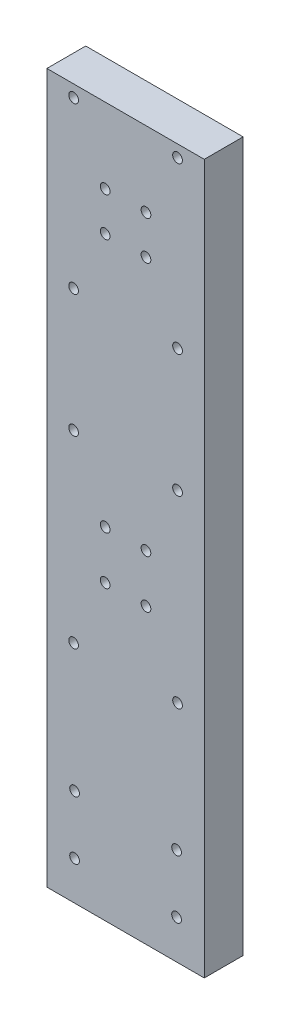
ISO-10303-21;
HEADER;
FILE_DESCRIPTION(('STEP AP214'),'2;1');
FILE_NAME('part.step','',(''),(''),'','','');
FILE_SCHEMA(('AUTOMOTIVE_DESIGN { 1 0 10303 214 1 1 1 1 }'));
ENDSEC;
DATA;
#1=APPLICATION_CONTEXT('core data for automotive mechanical design processes');
#2=APPLICATION_PROTOCOL_DEFINITION('international standard','automotive_design',2000,#1);
#3=PRODUCT_CONTEXT('',#1,'mechanical');
#4=PRODUCT('Part','Part','',(#3));
#5=PRODUCT_RELATED_PRODUCT_CATEGORY('part','',(#4));
#6=PRODUCT_DEFINITION_FORMATION('','',#4);
#7=PRODUCT_DEFINITION_CONTEXT('part definition',#1,'design');
#8=PRODUCT_DEFINITION('design','',#6,#7);
#9=PRODUCT_DEFINITION_SHAPE('','',#8);
#10=(LENGTH_UNIT() NAMED_UNIT(*) SI_UNIT(.MILLI.,.METRE.));
#11=(NAMED_UNIT(*) PLANE_ANGLE_UNIT() SI_UNIT($,.RADIAN.));
#12=(NAMED_UNIT(*) SI_UNIT($,.STERADIAN.) SOLID_ANGLE_UNIT());
#13=UNCERTAINTY_MEASURE_WITH_UNIT(LENGTH_MEASURE(1.E-05),#10,'distance_accuracy_value','');
#14=(GEOMETRIC_REPRESENTATION_CONTEXT(3) GLOBAL_UNCERTAINTY_ASSIGNED_CONTEXT((#13)) GLOBAL_UNIT_ASSIGNED_CONTEXT((#10,
#11,#12)) REPRESENTATION_CONTEXT('',''));
#15=CARTESIAN_POINT('',(0.,0.,0.));
#16=DIRECTION('',(0.,0.,1.));
#17=DIRECTION('',(1.,0.,0.));
#18=AXIS2_PLACEMENT_3D('',#15,#16,#17);
#19=CARTESIAN_POINT('',(0.,0.,4.));
#20=DIRECTION('',(0.,0.,-1.));
#21=DIRECTION('',(-1.,0.,0.));
#22=AXIS2_PLACEMENT_3D('',#19,#20,#21);
#23=PLANE('',#22);
#24=CARTESIAN_POINT('',(10.1999999999987,65.26,4.));
#25=DIRECTION('',(0.,0.,1.));
#26=DIRECTION('',(-1.,0.,0.));
#27=AXIS2_PLACEMENT_3D('',#24,#25,#26);
#28=CIRCLE('',#27,0.499999999999999);
#29=CARTESIAN_POINT('',(9.69999999999869,65.26,4.));
#30=VERTEX_POINT('',#29);
#31=EDGE_CURVE('E217',#30,#30,#28,.T.);
#32=ORIENTED_EDGE('',*,*,#31,.F.);
#33=EDGE_LOOP('',(#32));
#34=FACE_BOUND('',#33,.T.);
#35=CARTESIAN_POINT('',(2.7500000000006,54.76,4.));
#36=DIRECTION('',(0.,0.,1.));
#37=DIRECTION('',(1.,0.,0.));
#38=AXIS2_PLACEMENT_3D('',#35,#36,#37);
#39=CIRCLE('',#38,0.500000000000004);
#40=CARTESIAN_POINT('',(3.2500000000006,54.76,4.));
#41=VERTEX_POINT('',#40);
#42=EDGE_CURVE('E205',#41,#41,#39,.T.);
#43=ORIENTED_EDGE('',*,*,#42,.F.);
#44=EDGE_LOOP('',(#43));
#45=FACE_BOUND('',#44,.T.);
#46=CARTESIAN_POINT('',(13.350000000001,10.,4.));
#47=DIRECTION('',(0.,0.,1.));
#48=DIRECTION('',(-1.,0.,0.));
#49=AXIS2_PLACEMENT_3D('',#46,#47,#48);
#50=CIRCLE('',#49,0.499999999999994);
#51=CARTESIAN_POINT('',(12.850000000001,10.,4.));
#52=VERTEX_POINT('',#51);
#53=EDGE_CURVE('E193',#52,#52,#50,.T.);
#54=ORIENTED_EDGE('',*,*,#53,.F.);
#55=EDGE_LOOP('',(#54));
#56=FACE_BOUND('',#55,.T.);
#57=CARTESIAN_POINT('',(13.4500000000019,54.76,4.));
#58=DIRECTION('',(0.,0.,1.));
#59=DIRECTION('',(1.,0.,0.));
#60=AXIS2_PLACEMENT_3D('',#57,#58,#59);
#61=CIRCLE('',#60,0.499999999999999);
#62=CARTESIAN_POINT('',(13.9500000000019,54.76,4.));
#63=VERTEX_POINT('',#62);
#64=EDGE_CURVE('E181',#63,#63,#61,.T.);
#65=ORIENTED_EDGE('',*,*,#64,.F.);
#66=EDGE_LOOP('',(#65));
#67=FACE_BOUND('',#66,.T.);
#68=CARTESIAN_POINT('',(2.84999999999999,10.,4.));
#69=DIRECTION('',(0.,0.,1.));
#70=DIRECTION('',(1.,0.,0.));
#71=AXIS2_PLACEMENT_3D('',#68,#69,#70);
#72=CIRCLE('',#71,0.499999999999999);
#73=CARTESIAN_POINT('',(3.34999999999999,10.,4.));
#74=VERTEX_POINT('',#73);
#75=EDGE_CURVE('E169',#74,#74,#72,.T.);
#76=ORIENTED_EDGE('',*,*,#75,.F.);
#77=EDGE_LOOP('',(#76));
#78=FACE_BOUND('',#77,.T.);
#79=CARTESIAN_POINT('',(6.00000000000001,35.11,4.));
#80=DIRECTION('',(0.,0.,1.));
#81=DIRECTION('',(1.,0.,0.));
#82=AXIS2_PLACEMENT_3D('',#79,#80,#81);
#83=CIRCLE('',#82,0.500000000000002);
#84=CARTESIAN_POINT('',(6.50000000000001,35.11,4.));
#85=VERTEX_POINT('',#84);
#86=EDGE_CURVE('E157',#85,#85,#83,.T.);
#87=ORIENTED_EDGE('',*,*,#86,.F.);
#88=EDGE_LOOP('',(#87));
#89=FACE_BOUND('',#88,.T.);
#90=CARTESIAN_POINT('',(10.2000000000001,35.11,4.));
#91=DIRECTION('',(0.,0.,1.));
#92=DIRECTION('',(1.,0.,0.));
#93=AXIS2_PLACEMENT_3D('',#90,#91,#92);
#94=CIRCLE('',#93,0.499999999999999);
#95=CARTESIAN_POINT('',(10.7000000000001,35.11,4.));
#96=VERTEX_POINT('',#95);
#97=EDGE_CURVE('E145',#96,#96,#94,.T.);
#98=ORIENTED_EDGE('',*,*,#97,.F.);
#99=EDGE_LOOP('',(#98));
#100=FACE_BOUND('',#99,.T.);
#101=CARTESIAN_POINT('',(6.00000000000001,30.15,4.));
#102=DIRECTION('',(0.,0.,1.));
#103=DIRECTION('',(1.,0.,0.));
#104=AXIS2_PLACEMENT_3D('',#101,#102,#103);
#105=CIRCLE('',#104,0.5);
#106=CARTESIAN_POINT('',(6.50000000000001,30.15,4.));
#107=VERTEX_POINT('',#106);
#108=EDGE_CURVE('E133',#107,#107,#105,.T.);
#109=ORIENTED_EDGE('',*,*,#108,.F.);
#110=EDGE_LOOP('',(#109));
#111=FACE_BOUND('',#110,.T.);
#112=CARTESIAN_POINT('',(5.99999999999857,61.26,4.));
#113=DIRECTION('',(0.,0.,1.));
#114=DIRECTION('',(1.,0.,0.));
#115=AXIS2_PLACEMENT_3D('',#112,#113,#114);
#116=CIRCLE('',#115,0.500000000000003);
#117=CARTESIAN_POINT('',(6.49999999999857,61.26,4.));
#118=VERTEX_POINT('',#117);
#119=EDGE_CURVE('E121',#118,#118,#116,.T.);
#120=ORIENTED_EDGE('',*,*,#119,.F.);
#121=EDGE_LOOP('',(#120));
#122=FACE_BOUND('',#121,.T.);
#123=CARTESIAN_POINT('',(2.75000000000059,71.76,4.));
#124=DIRECTION('',(0.,0.,1.));
#125=DIRECTION('',(-1.,0.,0.));
#126=AXIS2_PLACEMENT_3D('',#123,#124,#125);
#127=CIRCLE('',#126,0.500000000000004);
#128=CARTESIAN_POINT('',(2.25000000000058,71.76,4.));
#129=VERTEX_POINT('',#128);
#130=EDGE_CURVE('E100',#129,#129,#127,.T.);
#131=ORIENTED_EDGE('',*,*,#130,.F.);
#132=EDGE_LOOP('',(#131));
#133=FACE_BOUND('',#132,.T.);
#134=DIRECTION('',(1.,0.,0.));
#135=VECTOR('',#134,1.);
#136=CARTESIAN_POINT('',(0.,0.,4.));
#137=LINE('',#136,#135);
#138=CARTESIAN_POINT('',(0.,0.,4.));
#139=VERTEX_POINT('',#138);
#140=CARTESIAN_POINT('',(16.2,0.,4.));
#141=VERTEX_POINT('',#140);
#142=EDGE_CURVE('E85',#139,#141,#137,.T.);
#143=ORIENTED_EDGE('',*,*,#142,.T.);
#144=DIRECTION('',(0.,1.,0.));
#145=VECTOR('',#144,1.);
#146=CARTESIAN_POINT('',(16.2,72.99,4.));
#147=LINE('',#146,#145);
#148=CARTESIAN_POINT('',(16.2,72.99,4.));
#149=VERTEX_POINT('',#148);
#150=EDGE_CURVE('E80',#141,#149,#147,.T.);
#151=ORIENTED_EDGE('',*,*,#150,.T.);
#152=DIRECTION('',(-1.,0.,0.));
#153=VECTOR('',#152,1.);
#154=CARTESIAN_POINT('',(0.,72.99,4.));
#155=LINE('',#154,#153);
#156=CARTESIAN_POINT('',(0.,72.99,4.));
#157=VERTEX_POINT('',#156);
#158=EDGE_CURVE('E83',#149,#157,#155,.T.);
#159=ORIENTED_EDGE('',*,*,#158,.T.);
#160=DIRECTION('',(0.,-1.,0.));
#161=VECTOR('',#160,1.);
#162=CARTESIAN_POINT('',(0.,0.,4.));
#163=LINE('',#162,#161);
#164=EDGE_CURVE('E50',#157,#139,#163,.T.);
#165=ORIENTED_EDGE('',*,*,#164,.T.);
#166=EDGE_LOOP('',(#143,#151,#159,#165));
#167=FACE_BOUND('',#166,.T.);
#168=CARTESIAN_POINT('',(10.1999999999987,61.26,4.));
#169=DIRECTION('',(0.,0.,1.));
#170=DIRECTION('',(1.,0.,0.));
#171=AXIS2_PLACEMENT_3D('',#168,#169,#170);
#172=CIRCLE('',#171,0.499999999999999);
#173=CARTESIAN_POINT('',(10.6999999999987,61.26,4.));
#174=VERTEX_POINT('',#173);
#175=EDGE_CURVE('E115',#174,#174,#172,.T.);
#176=ORIENTED_EDGE('',*,*,#175,.F.);
#177=EDGE_LOOP('',(#176));
#178=FACE_BOUND('',#177,.T.);
#179=CARTESIAN_POINT('',(10.2000000000001,30.15,4.));
#180=DIRECTION('',(0.,0.,1.));
#181=DIRECTION('',(1.,0.,0.));
#182=AXIS2_PLACEMENT_3D('',#179,#180,#181);
#183=CIRCLE('',#182,0.499999999999999);
#184=CARTESIAN_POINT('',(10.7000000000001,30.15,4.));
#185=VERTEX_POINT('',#184);
#186=EDGE_CURVE('E127',#185,#185,#183,.T.);
#187=ORIENTED_EDGE('',*,*,#186,.F.);
#188=EDGE_LOOP('',(#187));
#189=FACE_BOUND('',#188,.T.);
#190=CARTESIAN_POINT('',(13.4500000000001,23.15,4.));
#191=DIRECTION('',(0.,0.,1.));
#192=DIRECTION('',(1.,0.,0.));
#193=AXIS2_PLACEMENT_3D('',#190,#191,#192);
#194=CIRCLE('',#193,0.499999999999999);
#195=CARTESIAN_POINT('',(13.9500000000001,23.15,4.));
#196=VERTEX_POINT('',#195);
#197=EDGE_CURVE('E139',#196,#196,#194,.T.);
#198=ORIENTED_EDGE('',*,*,#197,.F.);
#199=EDGE_LOOP('',(#198));
#200=FACE_BOUND('',#199,.T.);
#201=CARTESIAN_POINT('',(2.75000000000003,23.15,4.));
#202=DIRECTION('',(0.,0.,1.));
#203=DIRECTION('',(1.,0.,0.));
#204=AXIS2_PLACEMENT_3D('',#201,#202,#203);
#205=CIRCLE('',#204,0.499999999999999);
#206=CARTESIAN_POINT('',(3.25000000000003,23.15,4.));
#207=VERTEX_POINT('',#206);
#208=EDGE_CURVE('E151',#207,#207,#205,.T.);
#209=ORIENTED_EDGE('',*,*,#208,.F.);
#210=EDGE_LOOP('',(#209));
#211=FACE_BOUND('',#210,.T.);
#212=CARTESIAN_POINT('',(13.45,42.11,4.));
#213=DIRECTION('',(0.,0.,1.));
#214=DIRECTION('',(1.,0.,0.));
#215=AXIS2_PLACEMENT_3D('',#212,#213,#214);
#216=CIRCLE('',#215,0.499999999999999);
#217=CARTESIAN_POINT('',(13.95,42.11,4.));
#218=VERTEX_POINT('',#217);
#219=EDGE_CURVE('E163',#218,#218,#216,.T.);
#220=ORIENTED_EDGE('',*,*,#219,.F.);
#221=EDGE_LOOP('',(#220));
#222=FACE_BOUND('',#221,.T.);
#223=CARTESIAN_POINT('',(2.75000000000003,42.11,4.));
#224=DIRECTION('',(0.,0.,1.));
#225=DIRECTION('',(1.,0.,0.));
#226=AXIS2_PLACEMENT_3D('',#223,#224,#225);
#227=CIRCLE('',#226,0.499999999999999);
#228=CARTESIAN_POINT('',(3.25000000000003,42.11,4.));
#229=VERTEX_POINT('',#228);
#230=EDGE_CURVE('E175',#229,#229,#227,.T.);
#231=ORIENTED_EDGE('',*,*,#230,.F.);
#232=EDGE_LOOP('',(#231));
#233=FACE_BOUND('',#232,.T.);
#234=CARTESIAN_POINT('',(2.84999999999999,4.,4.));
#235=DIRECTION('',(0.,0.,1.));
#236=DIRECTION('',(1.,0.,0.));
#237=AXIS2_PLACEMENT_3D('',#234,#235,#236);
#238=CIRCLE('',#237,0.499999999999999);
#239=CARTESIAN_POINT('',(3.34999999999999,4.,4.));
#240=VERTEX_POINT('',#239);
#241=EDGE_CURVE('E187',#240,#240,#238,.T.);
#242=ORIENTED_EDGE('',*,*,#241,.F.);
#243=EDGE_LOOP('',(#242));
#244=FACE_BOUND('',#243,.T.);
#245=CARTESIAN_POINT('',(13.350000000001,4.,4.));
#246=DIRECTION('',(0.,0.,1.));
#247=DIRECTION('',(-1.,0.,0.));
#248=AXIS2_PLACEMENT_3D('',#245,#246,#247);
#249=CIRCLE('',#248,0.499999999999995);
#250=CARTESIAN_POINT('',(12.850000000001,4.,4.));
#251=VERTEX_POINT('',#250);
#252=EDGE_CURVE('E199',#251,#251,#249,.T.);
#253=ORIENTED_EDGE('',*,*,#252,.F.);
#254=EDGE_LOOP('',(#253));
#255=FACE_BOUND('',#254,.T.);
#256=CARTESIAN_POINT('',(5.99999999999856,65.26,4.));
#257=DIRECTION('',(0.,0.,1.));
#258=DIRECTION('',(-1.,0.,0.));
#259=AXIS2_PLACEMENT_3D('',#256,#257,#258);
#260=CIRCLE('',#259,0.500000000000003);
#261=CARTESIAN_POINT('',(5.49999999999856,65.26,4.));
#262=VERTEX_POINT('',#261);
#263=EDGE_CURVE('E211',#262,#262,#260,.T.);
#264=ORIENTED_EDGE('',*,*,#263,.F.);
#265=EDGE_LOOP('',(#264));
#266=FACE_BOUND('',#265,.T.);
#267=CARTESIAN_POINT('',(13.4500000000019,71.76,4.));
#268=DIRECTION('',(0.,0.,1.));
#269=DIRECTION('',(-1.,0.,0.));
#270=AXIS2_PLACEMENT_3D('',#267,#268,#269);
#271=CIRCLE('',#270,0.500000000000006);
#272=CARTESIAN_POINT('',(12.9500000000019,71.76,4.));
#273=VERTEX_POINT('',#272);
#274=EDGE_CURVE('E223',#273,#273,#271,.T.);
#275=ORIENTED_EDGE('',*,*,#274,.F.);
#276=EDGE_LOOP('',(#275));
#277=FACE_BOUND('',#276,.T.);
#278=ADVANCED_FACE('F33',(#34,#45,#56,#67,#78,#89,#100,#111,#122,#133,#167,#178,#189,#200,#211,
#222,#233,#244,#255,#266,#277),#23,.F.);
#279=CARTESIAN_POINT('',(0.,0.,0.));
#280=DIRECTION('',(0.,0.,-1.));
#281=DIRECTION('',(-1.,0.,0.));
#282=AXIS2_PLACEMENT_3D('',#279,#280,#281);
#283=PLANE('',#282);
#284=CARTESIAN_POINT('',(10.1999999999987,65.26,0.));
#285=DIRECTION('',(0.,0.,1.));
#286=DIRECTION('',(-1.,0.,0.));
#287=AXIS2_PLACEMENT_3D('',#284,#285,#286);
#288=CIRCLE('',#287,0.499999999999999);
#289=CARTESIAN_POINT('',(9.69999999999869,65.26,0.));
#290=VERTEX_POINT('',#289);
#291=EDGE_CURVE('E220',#290,#290,#288,.T.);
#292=ORIENTED_EDGE('',*,*,#291,.T.);
#293=EDGE_LOOP('',(#292));
#294=FACE_BOUND('',#293,.T.);
#295=CARTESIAN_POINT('',(2.7500000000006,54.76,0.));
#296=DIRECTION('',(0.,0.,1.));
#297=DIRECTION('',(1.,0.,0.));
#298=AXIS2_PLACEMENT_3D('',#295,#296,#297);
#299=CIRCLE('',#298,0.500000000000004);
#300=CARTESIAN_POINT('',(3.2500000000006,54.76,0.));
#301=VERTEX_POINT('',#300);
#302=EDGE_CURVE('E208',#301,#301,#299,.T.);
#303=ORIENTED_EDGE('',*,*,#302,.T.);
#304=EDGE_LOOP('',(#303));
#305=FACE_BOUND('',#304,.T.);
#306=CARTESIAN_POINT('',(13.350000000001,10.,0.));
#307=DIRECTION('',(0.,0.,1.));
#308=DIRECTION('',(-1.,0.,0.));
#309=AXIS2_PLACEMENT_3D('',#306,#307,#308);
#310=CIRCLE('',#309,0.499999999999994);
#311=CARTESIAN_POINT('',(12.850000000001,10.,0.));
#312=VERTEX_POINT('',#311);
#313=EDGE_CURVE('E196',#312,#312,#310,.T.);
#314=ORIENTED_EDGE('',*,*,#313,.T.);
#315=EDGE_LOOP('',(#314));
#316=FACE_BOUND('',#315,.T.);
#317=CARTESIAN_POINT('',(13.4500000000019,54.76,0.));
#318=DIRECTION('',(0.,0.,1.));
#319=DIRECTION('',(1.,0.,0.));
#320=AXIS2_PLACEMENT_3D('',#317,#318,#319);
#321=CIRCLE('',#320,0.499999999999999);
#322=CARTESIAN_POINT('',(13.9500000000019,54.76,0.));
#323=VERTEX_POINT('',#322);
#324=EDGE_CURVE('E184',#323,#323,#321,.T.);
#325=ORIENTED_EDGE('',*,*,#324,.T.);
#326=EDGE_LOOP('',(#325));
#327=FACE_BOUND('',#326,.T.);
#328=CARTESIAN_POINT('',(2.84999999999999,10.,0.));
#329=DIRECTION('',(0.,0.,1.));
#330=DIRECTION('',(1.,0.,0.));
#331=AXIS2_PLACEMENT_3D('',#328,#329,#330);
#332=CIRCLE('',#331,0.499999999999999);
#333=CARTESIAN_POINT('',(3.34999999999999,10.,0.));
#334=VERTEX_POINT('',#333);
#335=EDGE_CURVE('E172',#334,#334,#332,.T.);
#336=ORIENTED_EDGE('',*,*,#335,.T.);
#337=EDGE_LOOP('',(#336));
#338=FACE_BOUND('',#337,.T.);
#339=CARTESIAN_POINT('',(6.00000000000001,35.11,0.));
#340=DIRECTION('',(0.,0.,1.));
#341=DIRECTION('',(1.,0.,0.));
#342=AXIS2_PLACEMENT_3D('',#339,#340,#341);
#343=CIRCLE('',#342,0.500000000000002);
#344=CARTESIAN_POINT('',(6.50000000000001,35.11,0.));
#345=VERTEX_POINT('',#344);
#346=EDGE_CURVE('E160',#345,#345,#343,.T.);
#347=ORIENTED_EDGE('',*,*,#346,.T.);
#348=EDGE_LOOP('',(#347));
#349=FACE_BOUND('',#348,.T.);
#350=CARTESIAN_POINT('',(10.2000000000001,35.11,0.));
#351=DIRECTION('',(0.,0.,1.));
#352=DIRECTION('',(1.,0.,0.));
#353=AXIS2_PLACEMENT_3D('',#350,#351,#352);
#354=CIRCLE('',#353,0.499999999999999);
#355=CARTESIAN_POINT('',(10.7000000000001,35.11,0.));
#356=VERTEX_POINT('',#355);
#357=EDGE_CURVE('E148',#356,#356,#354,.T.);
#358=ORIENTED_EDGE('',*,*,#357,.T.);
#359=EDGE_LOOP('',(#358));
#360=FACE_BOUND('',#359,.T.);
#361=CARTESIAN_POINT('',(6.00000000000001,30.15,0.));
#362=DIRECTION('',(0.,0.,1.));
#363=DIRECTION('',(1.,0.,0.));
#364=AXIS2_PLACEMENT_3D('',#361,#362,#363);
#365=CIRCLE('',#364,0.5);
#366=CARTESIAN_POINT('',(6.50000000000001,30.15,0.));
#367=VERTEX_POINT('',#366);
#368=EDGE_CURVE('E136',#367,#367,#365,.T.);
#369=ORIENTED_EDGE('',*,*,#368,.T.);
#370=EDGE_LOOP('',(#369));
#371=FACE_BOUND('',#370,.T.);
#372=CARTESIAN_POINT('',(5.99999999999857,61.26,0.));
#373=DIRECTION('',(0.,0.,1.));
#374=DIRECTION('',(1.,0.,0.));
#375=AXIS2_PLACEMENT_3D('',#372,#373,#374);
#376=CIRCLE('',#375,0.500000000000003);
#377=CARTESIAN_POINT('',(6.49999999999857,61.26,0.));
#378=VERTEX_POINT('',#377);
#379=EDGE_CURVE('E124',#378,#378,#376,.T.);
#380=ORIENTED_EDGE('',*,*,#379,.T.);
#381=EDGE_LOOP('',(#380));
#382=FACE_BOUND('',#381,.T.);
#383=CARTESIAN_POINT('',(2.75000000000059,71.76,0.));
#384=DIRECTION('',(0.,0.,1.));
#385=DIRECTION('',(-1.,0.,0.));
#386=AXIS2_PLACEMENT_3D('',#383,#384,#385);
#387=CIRCLE('',#386,0.500000000000004);
#388=CARTESIAN_POINT('',(2.25000000000058,71.76,0.));
#389=VERTEX_POINT('',#388);
#390=EDGE_CURVE('E112',#389,#389,#387,.T.);
#391=ORIENTED_EDGE('',*,*,#390,.T.);
#392=EDGE_LOOP('',(#391));
#393=FACE_BOUND('',#392,.T.);
#394=DIRECTION('',(1.,0.,0.));
#395=VECTOR('',#394,1.);
#396=CARTESIAN_POINT('',(0.,0.,0.));
#397=LINE('',#396,#395);
#398=CARTESIAN_POINT('',(0.,0.,0.));
#399=VERTEX_POINT('',#398);
#400=CARTESIAN_POINT('',(16.2,0.,0.));
#401=VERTEX_POINT('',#400);
#402=EDGE_CURVE('E97',#399,#401,#397,.T.);
#403=ORIENTED_EDGE('',*,*,#402,.F.);
#404=DIRECTION('',(0.,-1.,0.));
#405=VECTOR('',#404,1.);
#406=CARTESIAN_POINT('',(0.,0.,0.));
#407=LINE('',#406,#405);
#408=CARTESIAN_POINT('',(0.,72.99,0.));
#409=VERTEX_POINT('',#408);
#410=EDGE_CURVE('E73',#409,#399,#407,.T.);
#411=ORIENTED_EDGE('',*,*,#410,.F.);
#412=DIRECTION('',(-1.,0.,0.));
#413=VECTOR('',#412,1.);
#414=CARTESIAN_POINT('',(0.,72.99,0.));
#415=LINE('',#414,#413);
#416=CARTESIAN_POINT('',(16.2,72.99,0.));
#417=VERTEX_POINT('',#416);
#418=EDGE_CURVE('E67',#417,#409,#415,.T.);
#419=ORIENTED_EDGE('',*,*,#418,.F.);
#420=DIRECTION('',(0.,1.,0.));
#421=VECTOR('',#420,1.);
#422=CARTESIAN_POINT('',(16.2,72.99,0.));
#423=LINE('',#422,#421);
#424=EDGE_CURVE('E89',#401,#417,#423,.T.);
#425=ORIENTED_EDGE('',*,*,#424,.F.);
#426=EDGE_LOOP('',(#403,#411,#419,#425));
#427=FACE_BOUND('',#426,.T.);
#428=CARTESIAN_POINT('',(10.1999999999987,61.26,0.));
#429=DIRECTION('',(0.,0.,1.));
#430=DIRECTION('',(1.,0.,0.));
#431=AXIS2_PLACEMENT_3D('',#428,#429,#430);
#432=CIRCLE('',#431,0.499999999999999);
#433=CARTESIAN_POINT('',(10.6999999999987,61.26,0.));
#434=VERTEX_POINT('',#433);
#435=EDGE_CURVE('E118',#434,#434,#432,.T.);
#436=ORIENTED_EDGE('',*,*,#435,.T.);
#437=EDGE_LOOP('',(#436));
#438=FACE_BOUND('',#437,.T.);
#439=CARTESIAN_POINT('',(10.2000000000001,30.15,0.));
#440=DIRECTION('',(0.,0.,1.));
#441=DIRECTION('',(1.,0.,0.));
#442=AXIS2_PLACEMENT_3D('',#439,#440,#441);
#443=CIRCLE('',#442,0.499999999999999);
#444=CARTESIAN_POINT('',(10.7000000000001,30.15,0.));
#445=VERTEX_POINT('',#444);
#446=EDGE_CURVE('E130',#445,#445,#443,.T.);
#447=ORIENTED_EDGE('',*,*,#446,.T.);
#448=EDGE_LOOP('',(#447));
#449=FACE_BOUND('',#448,.T.);
#450=CARTESIAN_POINT('',(13.4500000000001,23.15,0.));
#451=DIRECTION('',(0.,0.,1.));
#452=DIRECTION('',(1.,0.,0.));
#453=AXIS2_PLACEMENT_3D('',#450,#451,#452);
#454=CIRCLE('',#453,0.499999999999999);
#455=CARTESIAN_POINT('',(13.9500000000001,23.15,0.));
#456=VERTEX_POINT('',#455);
#457=EDGE_CURVE('E142',#456,#456,#454,.T.);
#458=ORIENTED_EDGE('',*,*,#457,.T.);
#459=EDGE_LOOP('',(#458));
#460=FACE_BOUND('',#459,.T.);
#461=CARTESIAN_POINT('',(2.75000000000003,23.15,0.));
#462=DIRECTION('',(0.,0.,1.));
#463=DIRECTION('',(1.,0.,0.));
#464=AXIS2_PLACEMENT_3D('',#461,#462,#463);
#465=CIRCLE('',#464,0.499999999999999);
#466=CARTESIAN_POINT('',(3.25000000000003,23.15,0.));
#467=VERTEX_POINT('',#466);
#468=EDGE_CURVE('E154',#467,#467,#465,.T.);
#469=ORIENTED_EDGE('',*,*,#468,.T.);
#470=EDGE_LOOP('',(#469));
#471=FACE_BOUND('',#470,.T.);
#472=CARTESIAN_POINT('',(13.45,42.11,0.));
#473=DIRECTION('',(0.,0.,1.));
#474=DIRECTION('',(1.,0.,0.));
#475=AXIS2_PLACEMENT_3D('',#472,#473,#474);
#476=CIRCLE('',#475,0.499999999999999);
#477=CARTESIAN_POINT('',(13.95,42.11,0.));
#478=VERTEX_POINT('',#477);
#479=EDGE_CURVE('E166',#478,#478,#476,.T.);
#480=ORIENTED_EDGE('',*,*,#479,.T.);
#481=EDGE_LOOP('',(#480));
#482=FACE_BOUND('',#481,.T.);
#483=CARTESIAN_POINT('',(2.75000000000003,42.11,0.));
#484=DIRECTION('',(0.,0.,1.));
#485=DIRECTION('',(1.,0.,0.));
#486=AXIS2_PLACEMENT_3D('',#483,#484,#485);
#487=CIRCLE('',#486,0.499999999999999);
#488=CARTESIAN_POINT('',(3.25000000000003,42.11,0.));
#489=VERTEX_POINT('',#488);
#490=EDGE_CURVE('E178',#489,#489,#487,.T.);
#491=ORIENTED_EDGE('',*,*,#490,.T.);
#492=EDGE_LOOP('',(#491));
#493=FACE_BOUND('',#492,.T.);
#494=CARTESIAN_POINT('',(2.84999999999999,4.,0.));
#495=DIRECTION('',(0.,0.,1.));
#496=DIRECTION('',(1.,0.,0.));
#497=AXIS2_PLACEMENT_3D('',#494,#495,#496);
#498=CIRCLE('',#497,0.499999999999999);
#499=CARTESIAN_POINT('',(3.34999999999999,4.,0.));
#500=VERTEX_POINT('',#499);
#501=EDGE_CURVE('E190',#500,#500,#498,.T.);
#502=ORIENTED_EDGE('',*,*,#501,.T.);
#503=EDGE_LOOP('',(#502));
#504=FACE_BOUND('',#503,.T.);
#505=CARTESIAN_POINT('',(13.350000000001,4.,0.));
#506=DIRECTION('',(0.,0.,1.));
#507=DIRECTION('',(-1.,0.,0.));
#508=AXIS2_PLACEMENT_3D('',#505,#506,#507);
#509=CIRCLE('',#508,0.499999999999995);
#510=CARTESIAN_POINT('',(12.850000000001,4.,0.));
#511=VERTEX_POINT('',#510);
#512=EDGE_CURVE('E202',#511,#511,#509,.T.);
#513=ORIENTED_EDGE('',*,*,#512,.T.);
#514=EDGE_LOOP('',(#513));
#515=FACE_BOUND('',#514,.T.);
#516=CARTESIAN_POINT('',(5.99999999999856,65.26,0.));
#517=DIRECTION('',(0.,0.,1.));
#518=DIRECTION('',(-1.,0.,0.));
#519=AXIS2_PLACEMENT_3D('',#516,#517,#518);
#520=CIRCLE('',#519,0.500000000000003);
#521=CARTESIAN_POINT('',(5.49999999999856,65.26,0.));
#522=VERTEX_POINT('',#521);
#523=EDGE_CURVE('E214',#522,#522,#520,.T.);
#524=ORIENTED_EDGE('',*,*,#523,.T.);
#525=EDGE_LOOP('',(#524));
#526=FACE_BOUND('',#525,.T.);
#527=CARTESIAN_POINT('',(13.4500000000019,71.76,0.));
#528=DIRECTION('',(0.,0.,1.));
#529=DIRECTION('',(-1.,0.,0.));
#530=AXIS2_PLACEMENT_3D('',#527,#528,#529);
#531=CIRCLE('',#530,0.500000000000006);
#532=CARTESIAN_POINT('',(12.9500000000019,71.76,0.));
#533=VERTEX_POINT('',#532);
#534=EDGE_CURVE('E226',#533,#533,#531,.T.);
#535=ORIENTED_EDGE('',*,*,#534,.T.);
#536=EDGE_LOOP('',(#535));
#537=FACE_BOUND('',#536,.T.);
#538=ADVANCED_FACE('F108',(#294,#305,#316,#327,#338,#349,#360,#371,#382,#393,#427,#438,#449,
#460,#471,#482,#493,#504,#515,#526,#537),#283,.T.);
#539=CARTESIAN_POINT('',(0.,0.,4.));
#540=DIRECTION('',(0.,1.,0.));
#541=DIRECTION('',(0.,0.,1.));
#542=AXIS2_PLACEMENT_3D('',#539,#540,#541);
#543=PLANE('',#542);
#544=ORIENTED_EDGE('',*,*,#402,.T.);
#545=DIRECTION('',(0.,0.,-1.));
#546=VECTOR('',#545,1.);
#547=CARTESIAN_POINT('',(16.2,0.,4.));
#548=LINE('',#547,#546);
#549=EDGE_CURVE('E11',#141,#401,#548,.T.);
#550=ORIENTED_EDGE('',*,*,#549,.F.);
#551=ORIENTED_EDGE('',*,*,#142,.F.);
#552=DIRECTION('',(0.,0.,-1.));
#553=VECTOR('',#552,1.);
#554=CARTESIAN_POINT('',(0.,0.,4.));
#555=LINE('',#554,#553);
#556=EDGE_CURVE('E93',#139,#399,#555,.T.);
#557=ORIENTED_EDGE('',*,*,#556,.T.);
#558=EDGE_LOOP('',(#544,#550,#551,#557));
#559=FACE_BOUND('',#558,.T.);
#560=ADVANCED_FACE('F35',(#559),#543,.F.);
#561=CARTESIAN_POINT('',(16.2,72.99,4.));
#562=DIRECTION('',(-1.,0.,0.));
#563=DIRECTION('',(0.,-1.,0.));
#564=AXIS2_PLACEMENT_3D('',#561,#562,#563);
#565=PLANE('',#564);
#566=ORIENTED_EDGE('',*,*,#424,.T.);
#567=DIRECTION('',(0.,0.,-1.));
#568=VECTOR('',#567,1.);
#569=CARTESIAN_POINT('',(16.2,72.99,4.));
#570=LINE('',#569,#568);
#571=EDGE_CURVE('E42',#149,#417,#570,.T.);
#572=ORIENTED_EDGE('',*,*,#571,.F.);
#573=ORIENTED_EDGE('',*,*,#150,.F.);
#574=ORIENTED_EDGE('',*,*,#549,.T.);
#575=EDGE_LOOP('',(#566,#572,#573,#574));
#576=FACE_BOUND('',#575,.T.);
#577=ADVANCED_FACE('F88',(#576),#565,.F.);
#578=CARTESIAN_POINT('',(0.,72.99,4.));
#579=DIRECTION('',(0.,-1.,0.));
#580=DIRECTION('',(0.,0.,-1.));
#581=AXIS2_PLACEMENT_3D('',#578,#579,#580);
#582=PLANE('',#581);
#583=ORIENTED_EDGE('',*,*,#418,.T.);
#584=DIRECTION('',(0.,0.,-1.));
#585=VECTOR('',#584,1.);
#586=CARTESIAN_POINT('',(0.,72.99,4.));
#587=LINE('',#586,#585);
#588=EDGE_CURVE('E90',#157,#409,#587,.T.);
#589=ORIENTED_EDGE('',*,*,#588,.F.);
#590=ORIENTED_EDGE('',*,*,#158,.F.);
#591=ORIENTED_EDGE('',*,*,#571,.T.);
#592=EDGE_LOOP('',(#583,#589,#590,#591));
#593=FACE_BOUND('',#592,.T.);
#594=ADVANCED_FACE('F91',(#593),#582,.F.);
#595=CARTESIAN_POINT('',(0.,0.,4.));
#596=DIRECTION('',(1.,0.,0.));
#597=DIRECTION('',(0.,0.,-1.));
#598=AXIS2_PLACEMENT_3D('',#595,#596,#597);
#599=PLANE('',#598);
#600=ORIENTED_EDGE('',*,*,#410,.T.);
#601=ORIENTED_EDGE('',*,*,#556,.F.);
#602=ORIENTED_EDGE('',*,*,#164,.F.);
#603=ORIENTED_EDGE('',*,*,#588,.T.);
#604=EDGE_LOOP('',(#600,#601,#602,#603));
#605=FACE_BOUND('',#604,.T.);
#606=ADVANCED_FACE('F105',(#605),#599,.F.);
#607=CARTESIAN_POINT('',(2.75000000000059,71.76,4.));
#608=DIRECTION('',(0.,0.,-1.));
#609=DIRECTION('',(-1.,0.,0.));
#610=AXIS2_PLACEMENT_3D('',#607,#608,#609);
#611=CYLINDRICAL_SURFACE('',#610,0.500000000000004);
#612=ORIENTED_EDGE('',*,*,#130,.T.);
#613=EDGE_LOOP('',(#612));
#614=FACE_BOUND('',#613,.T.);
#615=ORIENTED_EDGE('',*,*,#390,.F.);
#616=EDGE_LOOP('',(#615));
#617=FACE_BOUND('',#616,.T.);
#618=ADVANCED_FACE('F246',(#614,#617),#611,.F.);
#619=CARTESIAN_POINT('',(10.1999999999987,61.26,4.));
#620=DIRECTION('',(0.,0.,-1.));
#621=DIRECTION('',(-1.,0.,0.));
#622=AXIS2_PLACEMENT_3D('',#619,#620,#621);
#623=CYLINDRICAL_SURFACE('',#622,0.499999999999999);
#624=ORIENTED_EDGE('',*,*,#175,.T.);
#625=EDGE_LOOP('',(#624));
#626=FACE_BOUND('',#625,.T.);
#627=ORIENTED_EDGE('',*,*,#435,.F.);
#628=EDGE_LOOP('',(#627));
#629=FACE_BOUND('',#628,.T.);
#630=ADVANCED_FACE('F292',(#626,#629),#623,.F.);
#631=CARTESIAN_POINT('',(5.99999999999857,61.26,4.));
#632=DIRECTION('',(0.,0.,-1.));
#633=DIRECTION('',(-1.,0.,0.));
#634=AXIS2_PLACEMENT_3D('',#631,#632,#633);
#635=CYLINDRICAL_SURFACE('',#634,0.500000000000003);
#636=ORIENTED_EDGE('',*,*,#119,.T.);
#637=EDGE_LOOP('',(#636));
#638=FACE_BOUND('',#637,.T.);
#639=ORIENTED_EDGE('',*,*,#379,.F.);
#640=EDGE_LOOP('',(#639));
#641=FACE_BOUND('',#640,.T.);
#642=ADVANCED_FACE('F300',(#638,#641),#635,.F.);
#643=CARTESIAN_POINT('',(10.2000000000001,30.15,4.));
#644=DIRECTION('',(0.,0.,-1.));
#645=DIRECTION('',(-1.,0.,0.));
#646=AXIS2_PLACEMENT_3D('',#643,#644,#645);
#647=CYLINDRICAL_SURFACE('',#646,0.499999999999999);
#648=ORIENTED_EDGE('',*,*,#186,.T.);
#649=EDGE_LOOP('',(#648));
#650=FACE_BOUND('',#649,.T.);
#651=ORIENTED_EDGE('',*,*,#446,.F.);
#652=EDGE_LOOP('',(#651));
#653=FACE_BOUND('',#652,.T.);
#654=ADVANCED_FACE('F308',(#650,#653),#647,.F.);
#655=CARTESIAN_POINT('',(6.00000000000001,30.15,4.));
#656=DIRECTION('',(0.,0.,-1.));
#657=DIRECTION('',(-1.,0.,0.));
#658=AXIS2_PLACEMENT_3D('',#655,#656,#657);
#659=CYLINDRICAL_SURFACE('',#658,0.5);
#660=ORIENTED_EDGE('',*,*,#108,.T.);
#661=EDGE_LOOP('',(#660));
#662=FACE_BOUND('',#661,.T.);
#663=ORIENTED_EDGE('',*,*,#368,.F.);
#664=EDGE_LOOP('',(#663));
#665=FACE_BOUND('',#664,.T.);
#666=ADVANCED_FACE('F317',(#662,#665),#659,.F.);
#667=CARTESIAN_POINT('',(13.4500000000001,23.15,4.));
#668=DIRECTION('',(0.,0.,-1.));
#669=DIRECTION('',(-1.,0.,0.));
#670=AXIS2_PLACEMENT_3D('',#667,#668,#669);
#671=CYLINDRICAL_SURFACE('',#670,0.499999999999999);
#672=ORIENTED_EDGE('',*,*,#197,.T.);
#673=EDGE_LOOP('',(#672));
#674=FACE_BOUND('',#673,.T.);
#675=ORIENTED_EDGE('',*,*,#457,.F.);
#676=EDGE_LOOP('',(#675));
#677=FACE_BOUND('',#676,.T.);
#678=ADVANCED_FACE('F326',(#674,#677),#671,.F.);
#679=CARTESIAN_POINT('',(10.2000000000001,35.11,4.));
#680=DIRECTION('',(0.,0.,-1.));
#681=DIRECTION('',(-1.,0.,0.));
#682=AXIS2_PLACEMENT_3D('',#679,#680,#681);
#683=CYLINDRICAL_SURFACE('',#682,0.499999999999999);
#684=ORIENTED_EDGE('',*,*,#97,.T.);
#685=EDGE_LOOP('',(#684));
#686=FACE_BOUND('',#685,.T.);
#687=ORIENTED_EDGE('',*,*,#357,.F.);
#688=EDGE_LOOP('',(#687));
#689=FACE_BOUND('',#688,.T.);
#690=ADVANCED_FACE('F335',(#686,#689),#683,.F.);
#691=CARTESIAN_POINT('',(2.75000000000003,23.15,4.));
#692=DIRECTION('',(0.,0.,-1.));
#693=DIRECTION('',(-1.,0.,0.));
#694=AXIS2_PLACEMENT_3D('',#691,#692,#693);
#695=CYLINDRICAL_SURFACE('',#694,0.499999999999999);
#696=ORIENTED_EDGE('',*,*,#208,.T.);
#697=EDGE_LOOP('',(#696));
#698=FACE_BOUND('',#697,.T.);
#699=ORIENTED_EDGE('',*,*,#468,.F.);
#700=EDGE_LOOP('',(#699));
#701=FACE_BOUND('',#700,.T.);
#702=ADVANCED_FACE('F344',(#698,#701),#695,.F.);
#703=CARTESIAN_POINT('',(6.00000000000001,35.11,4.));
#704=DIRECTION('',(0.,0.,-1.));
#705=DIRECTION('',(-1.,0.,0.));
#706=AXIS2_PLACEMENT_3D('',#703,#704,#705);
#707=CYLINDRICAL_SURFACE('',#706,0.500000000000002);
#708=ORIENTED_EDGE('',*,*,#86,.T.);
#709=EDGE_LOOP('',(#708));
#710=FACE_BOUND('',#709,.T.);
#711=ORIENTED_EDGE('',*,*,#346,.F.);
#712=EDGE_LOOP('',(#711));
#713=FACE_BOUND('',#712,.T.);
#714=ADVANCED_FACE('F353',(#710,#713),#707,.F.);
#715=CARTESIAN_POINT('',(13.45,42.11,4.));
#716=DIRECTION('',(0.,0.,-1.));
#717=DIRECTION('',(-1.,0.,0.));
#718=AXIS2_PLACEMENT_3D('',#715,#716,#717);
#719=CYLINDRICAL_SURFACE('',#718,0.499999999999999);
#720=ORIENTED_EDGE('',*,*,#219,.T.);
#721=EDGE_LOOP('',(#720));
#722=FACE_BOUND('',#721,.T.);
#723=ORIENTED_EDGE('',*,*,#479,.F.);
#724=EDGE_LOOP('',(#723));
#725=FACE_BOUND('',#724,.T.);
#726=ADVANCED_FACE('F362',(#722,#725),#719,.F.);
#727=CARTESIAN_POINT('',(2.84999999999999,10.,4.));
#728=DIRECTION('',(0.,0.,-1.));
#729=DIRECTION('',(-1.,0.,0.));
#730=AXIS2_PLACEMENT_3D('',#727,#728,#729);
#731=CYLINDRICAL_SURFACE('',#730,0.499999999999999);
#732=ORIENTED_EDGE('',*,*,#75,.T.);
#733=EDGE_LOOP('',(#732));
#734=FACE_BOUND('',#733,.T.);
#735=ORIENTED_EDGE('',*,*,#335,.F.);
#736=EDGE_LOOP('',(#735));
#737=FACE_BOUND('',#736,.T.);
#738=ADVANCED_FACE('F371',(#734,#737),#731,.F.);
#739=CARTESIAN_POINT('',(2.75000000000003,42.11,4.));
#740=DIRECTION('',(0.,0.,-1.));
#741=DIRECTION('',(-1.,0.,0.));
#742=AXIS2_PLACEMENT_3D('',#739,#740,#741);
#743=CYLINDRICAL_SURFACE('',#742,0.499999999999999);
#744=ORIENTED_EDGE('',*,*,#230,.T.);
#745=EDGE_LOOP('',(#744));
#746=FACE_BOUND('',#745,.T.);
#747=ORIENTED_EDGE('',*,*,#490,.F.);
#748=EDGE_LOOP('',(#747));
#749=FACE_BOUND('',#748,.T.);
#750=ADVANCED_FACE('F380',(#746,#749),#743,.F.);
#751=CARTESIAN_POINT('',(13.4500000000019,54.76,4.));
#752=DIRECTION('',(0.,0.,-1.));
#753=DIRECTION('',(-1.,0.,0.));
#754=AXIS2_PLACEMENT_3D('',#751,#752,#753);
#755=CYLINDRICAL_SURFACE('',#754,0.499999999999999);
#756=ORIENTED_EDGE('',*,*,#64,.T.);
#757=EDGE_LOOP('',(#756));
#758=FACE_BOUND('',#757,.T.);
#759=ORIENTED_EDGE('',*,*,#324,.F.);
#760=EDGE_LOOP('',(#759));
#761=FACE_BOUND('',#760,.T.);
#762=ADVANCED_FACE('F389',(#758,#761),#755,.F.);
#763=CARTESIAN_POINT('',(2.84999999999999,4.,4.));
#764=DIRECTION('',(0.,0.,-1.));
#765=DIRECTION('',(-1.,0.,0.));
#766=AXIS2_PLACEMENT_3D('',#763,#764,#765);
#767=CYLINDRICAL_SURFACE('',#766,0.499999999999999);
#768=ORIENTED_EDGE('',*,*,#241,.T.);
#769=EDGE_LOOP('',(#768));
#770=FACE_BOUND('',#769,.T.);
#771=ORIENTED_EDGE('',*,*,#501,.F.);
#772=EDGE_LOOP('',(#771));
#773=FACE_BOUND('',#772,.T.);
#774=ADVANCED_FACE('F398',(#770,#773),#767,.F.);
#775=CARTESIAN_POINT('',(13.350000000001,10.,4.));
#776=DIRECTION('',(0.,0.,-1.));
#777=DIRECTION('',(-1.,0.,0.));
#778=AXIS2_PLACEMENT_3D('',#775,#776,#777);
#779=CYLINDRICAL_SURFACE('',#778,0.499999999999994);
#780=ORIENTED_EDGE('',*,*,#53,.T.);
#781=EDGE_LOOP('',(#780));
#782=FACE_BOUND('',#781,.T.);
#783=ORIENTED_EDGE('',*,*,#313,.F.);
#784=EDGE_LOOP('',(#783));
#785=FACE_BOUND('',#784,.T.);
#786=ADVANCED_FACE('F407',(#782,#785),#779,.F.);
#787=CARTESIAN_POINT('',(13.350000000001,4.,4.));
#788=DIRECTION('',(0.,0.,-1.));
#789=DIRECTION('',(-1.,0.,0.));
#790=AXIS2_PLACEMENT_3D('',#787,#788,#789);
#791=CYLINDRICAL_SURFACE('',#790,0.499999999999995);
#792=ORIENTED_EDGE('',*,*,#252,.T.);
#793=EDGE_LOOP('',(#792));
#794=FACE_BOUND('',#793,.T.);
#795=ORIENTED_EDGE('',*,*,#512,.F.);
#796=EDGE_LOOP('',(#795));
#797=FACE_BOUND('',#796,.T.);
#798=ADVANCED_FACE('F416',(#794,#797),#791,.F.);
#799=CARTESIAN_POINT('',(2.7500000000006,54.76,4.));
#800=DIRECTION('',(0.,0.,-1.));
#801=DIRECTION('',(-1.,0.,0.));
#802=AXIS2_PLACEMENT_3D('',#799,#800,#801);
#803=CYLINDRICAL_SURFACE('',#802,0.500000000000004);
#804=ORIENTED_EDGE('',*,*,#42,.T.);
#805=EDGE_LOOP('',(#804));
#806=FACE_BOUND('',#805,.T.);
#807=ORIENTED_EDGE('',*,*,#302,.F.);
#808=EDGE_LOOP('',(#807));
#809=FACE_BOUND('',#808,.T.);
#810=ADVANCED_FACE('F425',(#806,#809),#803,.F.);
#811=CARTESIAN_POINT('',(5.99999999999856,65.26,4.));
#812=DIRECTION('',(0.,0.,-1.));
#813=DIRECTION('',(-1.,0.,0.));
#814=AXIS2_PLACEMENT_3D('',#811,#812,#813);
#815=CYLINDRICAL_SURFACE('',#814,0.500000000000003);
#816=ORIENTED_EDGE('',*,*,#263,.T.);
#817=EDGE_LOOP('',(#816));
#818=FACE_BOUND('',#817,.T.);
#819=ORIENTED_EDGE('',*,*,#523,.F.);
#820=EDGE_LOOP('',(#819));
#821=FACE_BOUND('',#820,.T.);
#822=ADVANCED_FACE('F434',(#818,#821),#815,.F.);
#823=CARTESIAN_POINT('',(10.1999999999987,65.26,4.));
#824=DIRECTION('',(0.,0.,-1.));
#825=DIRECTION('',(-1.,0.,0.));
#826=AXIS2_PLACEMENT_3D('',#823,#824,#825);
#827=CYLINDRICAL_SURFACE('',#826,0.499999999999999);
#828=ORIENTED_EDGE('',*,*,#31,.T.);
#829=EDGE_LOOP('',(#828));
#830=FACE_BOUND('',#829,.T.);
#831=ORIENTED_EDGE('',*,*,#291,.F.);
#832=EDGE_LOOP('',(#831));
#833=FACE_BOUND('',#832,.T.);
#834=ADVANCED_FACE('F443',(#830,#833),#827,.F.);
#835=CARTESIAN_POINT('',(13.4500000000019,71.76,4.));
#836=DIRECTION('',(0.,0.,-1.));
#837=DIRECTION('',(-1.,0.,0.));
#838=AXIS2_PLACEMENT_3D('',#835,#836,#837);
#839=CYLINDRICAL_SURFACE('',#838,0.500000000000006);
#840=ORIENTED_EDGE('',*,*,#274,.T.);
#841=EDGE_LOOP('',(#840));
#842=FACE_BOUND('',#841,.T.);
#843=ORIENTED_EDGE('',*,*,#534,.F.);
#844=EDGE_LOOP('',(#843));
#845=FACE_BOUND('',#844,.T.);
#846=ADVANCED_FACE('F232',(#842,#845),#839,.F.);
#847=CLOSED_SHELL('',(#278,#538,#560,#577,#594,#606,#618,#630,#642,#654,#666,#678,#690,#702,
#714,#726,#738,#750,#762,#774,#786,#798,#810,#822,#834,#846));
#848=MANIFOLD_SOLID_BREP('B2',#847);
#849=ADVANCED_BREP_SHAPE_REPRESENTATION('',(#18,#848),#14);
#850=SHAPE_DEFINITION_REPRESENTATION(#9,#849);
ENDSEC;
END-ISO-10303-21;
